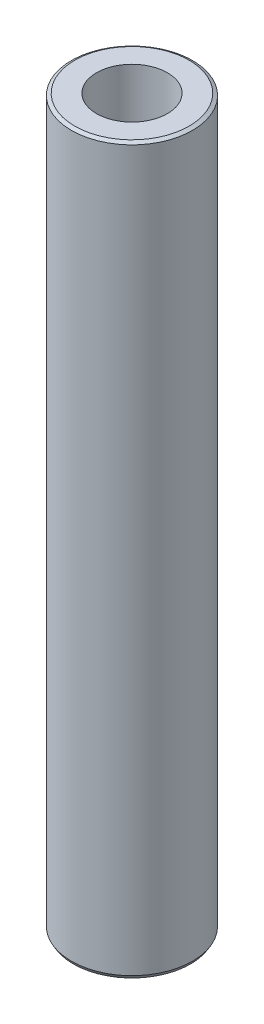
ISO-10303-21;
HEADER;
FILE_DESCRIPTION(('STEP AP214'),'2;1');
FILE_NAME('part.step','',(''),(''),'','','');
FILE_SCHEMA(('AUTOMOTIVE_DESIGN { 1 0 10303 214 1 1 1 1 }'));
ENDSEC;
DATA;
#1=APPLICATION_CONTEXT('core data for automotive mechanical design processes');
#2=APPLICATION_PROTOCOL_DEFINITION('international standard','automotive_design',2000,#1);
#3=PRODUCT_CONTEXT('',#1,'mechanical');
#4=PRODUCT('Part','Part','',(#3));
#5=PRODUCT_RELATED_PRODUCT_CATEGORY('part','',(#4));
#6=PRODUCT_DEFINITION_FORMATION('','',#4);
#7=PRODUCT_DEFINITION_CONTEXT('part definition',#1,'design');
#8=PRODUCT_DEFINITION('design','',#6,#7);
#9=PRODUCT_DEFINITION_SHAPE('','',#8);
#10=(LENGTH_UNIT() NAMED_UNIT(*) SI_UNIT(.MILLI.,.METRE.));
#11=(NAMED_UNIT(*) PLANE_ANGLE_UNIT() SI_UNIT($,.RADIAN.));
#12=(NAMED_UNIT(*) SI_UNIT($,.STERADIAN.) SOLID_ANGLE_UNIT());
#13=UNCERTAINTY_MEASURE_WITH_UNIT(LENGTH_MEASURE(1.E-05),#10,'distance_accuracy_value','');
#14=(GEOMETRIC_REPRESENTATION_CONTEXT(3) GLOBAL_UNCERTAINTY_ASSIGNED_CONTEXT((#13)) GLOBAL_UNIT_ASSIGNED_CONTEXT((#10,
#11,#12)) REPRESENTATION_CONTEXT('',''));
#15=CARTESIAN_POINT('',(0.,0.,0.));
#16=DIRECTION('',(0.,0.,1.));
#17=DIRECTION('',(1.,0.,0.));
#18=AXIS2_PLACEMENT_3D('',#15,#16,#17);
#19=CARTESIAN_POINT('',(0.,89.7761890394456,0.));
#20=DIRECTION('',(0.,-1.,0.));
#21=DIRECTION('',(0.,0.,-1.));
#22=AXIS2_PLACEMENT_3D('',#19,#20,#21);
#23=CYLINDRICAL_SURFACE('',#22,7.5);
#24=CARTESIAN_POINT('',(0.,89.5333908186672,0.));
#25=DIRECTION('',(0.,1.,0.));
#26=DIRECTION('',(0.,0.,1.));
#27=AXIS2_PLACEMENT_3D('',#24,#25,#26);
#28=CIRCLE('',#27,7.5);
#29=CARTESIAN_POINT('',(0.,89.5333908186672,7.5));
#30=VERTEX_POINT('',#29);
#31=EDGE_CURVE('E50',#30,#30,#28,.F.);
#32=ORIENTED_EDGE('',*,*,#31,.T.);
#33=EDGE_LOOP('',(#32));
#34=FACE_BOUND('',#33,.T.);
#35=CARTESIAN_POINT('',(0.,0.420538854375513,0.));
#36=DIRECTION('',(0.,1.,0.));
#37=DIRECTION('',(0.,0.,1.));
#38=AXIS2_PLACEMENT_3D('',#35,#36,#37);
#39=CIRCLE('',#38,7.5);
#40=CARTESIAN_POINT('',(0.,0.420538854375513,7.5));
#41=VERTEX_POINT('',#40);
#42=EDGE_CURVE('E51',#41,#41,#39,.T.);
#43=ORIENTED_EDGE('',*,*,#42,.T.);
#44=EDGE_LOOP('',(#43));
#45=FACE_BOUND('',#44,.T.);
#46=ADVANCED_FACE('F39',(#34,#45),#23,.T.);
#47=CARTESIAN_POINT('',(0.,89.7761890394456,0.));
#48=DIRECTION('',(0.,1.,0.));
#49=DIRECTION('',(0.,0.,1.));
#50=AXIS2_PLACEMENT_3D('',#47,#48,#49);
#51=PLANE('',#50);
#52=CARTESIAN_POINT('',(0.,89.7761890394456,0.));
#53=DIRECTION('',(0.,1.,0.));
#54=DIRECTION('',(0.,0.,1.));
#55=AXIS2_PLACEMENT_3D('',#52,#53,#54);
#56=CIRCLE('',#55,7.07946114562454);
#57=CARTESIAN_POINT('',(0.,89.7761890394456,7.07946114562454));
#58=VERTEX_POINT('',#57);
#59=EDGE_CURVE('E54',#58,#58,#56,.T.);
#60=ORIENTED_EDGE('',*,*,#59,.T.);
#61=EDGE_LOOP('',(#60));
#62=FACE_BOUND('',#61,.T.);
#63=CARTESIAN_POINT('',(0.,89.7761890394456,0.));
#64=DIRECTION('',(0.,1.,0.));
#65=DIRECTION('',(0.,0.,1.));
#66=AXIS2_PLACEMENT_3D('',#63,#64,#65);
#67=CIRCLE('',#66,4.39003114644553);
#68=CARTESIAN_POINT('',(0.,89.7761890394456,4.39003114644553));
#69=VERTEX_POINT('',#68);
#70=EDGE_CURVE('E58',#69,#69,#67,.T.);
#71=ORIENTED_EDGE('',*,*,#70,.F.);
#72=EDGE_LOOP('',(#71));
#73=FACE_BOUND('',#72,.T.);
#74=ADVANCED_FACE('F69',(#62,#73),#51,.T.);
#75=CARTESIAN_POINT('',(0.,0.,0.));
#76=DIRECTION('',(0.,1.,0.));
#77=DIRECTION('',(0.,0.,1.));
#78=AXIS2_PLACEMENT_3D('',#75,#76,#77);
#79=PLANE('',#78);
#80=CARTESIAN_POINT('',(0.,0.,0.));
#81=DIRECTION('',(0.,1.,0.));
#82=DIRECTION('',(0.,0.,1.));
#83=AXIS2_PLACEMENT_3D('',#80,#81,#82);
#84=CIRCLE('',#83,7.2572017792216);
#85=CARTESIAN_POINT('',(0.,0.,7.2572017792216));
#86=VERTEX_POINT('',#85);
#87=EDGE_CURVE('E10',#86,#86,#84,.F.);
#88=ORIENTED_EDGE('',*,*,#87,.T.);
#89=EDGE_LOOP('',(#88));
#90=FACE_BOUND('',#89,.T.);
#91=CARTESIAN_POINT('',(0.,0.,0.));
#92=DIRECTION('',(0.,1.,0.));
#93=DIRECTION('',(0.,0.,1.));
#94=AXIS2_PLACEMENT_3D('',#91,#92,#93);
#95=CIRCLE('',#94,4.39003114644553);
#96=CARTESIAN_POINT('',(0.,0.,4.39003114644553));
#97=VERTEX_POINT('',#96);
#98=EDGE_CURVE('E63',#97,#97,#95,.T.);
#99=ORIENTED_EDGE('',*,*,#98,.T.);
#100=EDGE_LOOP('',(#99));
#101=FACE_BOUND('',#100,.T.);
#102=ADVANCED_FACE('F75',(#90,#101),#79,.F.);
#103=CARTESIAN_POINT('',(0.,89.7761890394456,0.));
#104=DIRECTION('',(0.,-1.,0.));
#105=DIRECTION('',(0.,0.,-1.));
#106=AXIS2_PLACEMENT_3D('',#103,#104,#105);
#107=CYLINDRICAL_SURFACE('',#106,4.39003114644553);
#108=ORIENTED_EDGE('',*,*,#70,.T.);
#109=EDGE_LOOP('',(#108));
#110=FACE_BOUND('',#109,.T.);
#111=ORIENTED_EDGE('',*,*,#98,.F.);
#112=EDGE_LOOP('',(#111));
#113=FACE_BOUND('',#112,.T.);
#114=ADVANCED_FACE('F70',(#110,#113),#107,.F.);
#115=CARTESIAN_POINT('',(0.,89.7761890394456,0.));
#116=DIRECTION('',(0.,-1.,0.));
#117=DIRECTION('',(0.,0.,-1.));
#118=AXIS2_PLACEMENT_3D('',#115,#116,#117);
#119=CONICAL_SURFACE('',#118,7.07946114562454,1.04719755119657);
#120=ORIENTED_EDGE('',*,*,#31,.F.);
#121=EDGE_LOOP('',(#120));
#122=FACE_BOUND('',#121,.T.);
#123=ORIENTED_EDGE('',*,*,#59,.F.);
#124=EDGE_LOOP('',(#123));
#125=FACE_BOUND('',#124,.T.);
#126=ADVANCED_FACE('F81',(#122,#125),#119,.T.);
#127=CARTESIAN_POINT('',(0.,0.420538854375513,0.));
#128=DIRECTION('',(0.,1.,0.));
#129=DIRECTION('',(0.,0.,1.));
#130=AXIS2_PLACEMENT_3D('',#127,#128,#129);
#131=CONICAL_SURFACE('',#130,7.5,0.523598775598297);
#132=ORIENTED_EDGE('',*,*,#87,.F.);
#133=EDGE_LOOP('',(#132));
#134=FACE_BOUND('',#133,.T.);
#135=ORIENTED_EDGE('',*,*,#42,.F.);
#136=EDGE_LOOP('',(#135));
#137=FACE_BOUND('',#136,.T.);
#138=ADVANCED_FACE('F45',(#134,#137),#131,.T.);
#139=CLOSED_SHELL('',(#46,#74,#102,#114,#126,#138));
#140=MANIFOLD_SOLID_BREP('B2',#139);
#141=ADVANCED_BREP_SHAPE_REPRESENTATION('',(#18,#140),#14);
#142=SHAPE_DEFINITION_REPRESENTATION(#9,#141);
ENDSEC;
END-ISO-10303-21;
